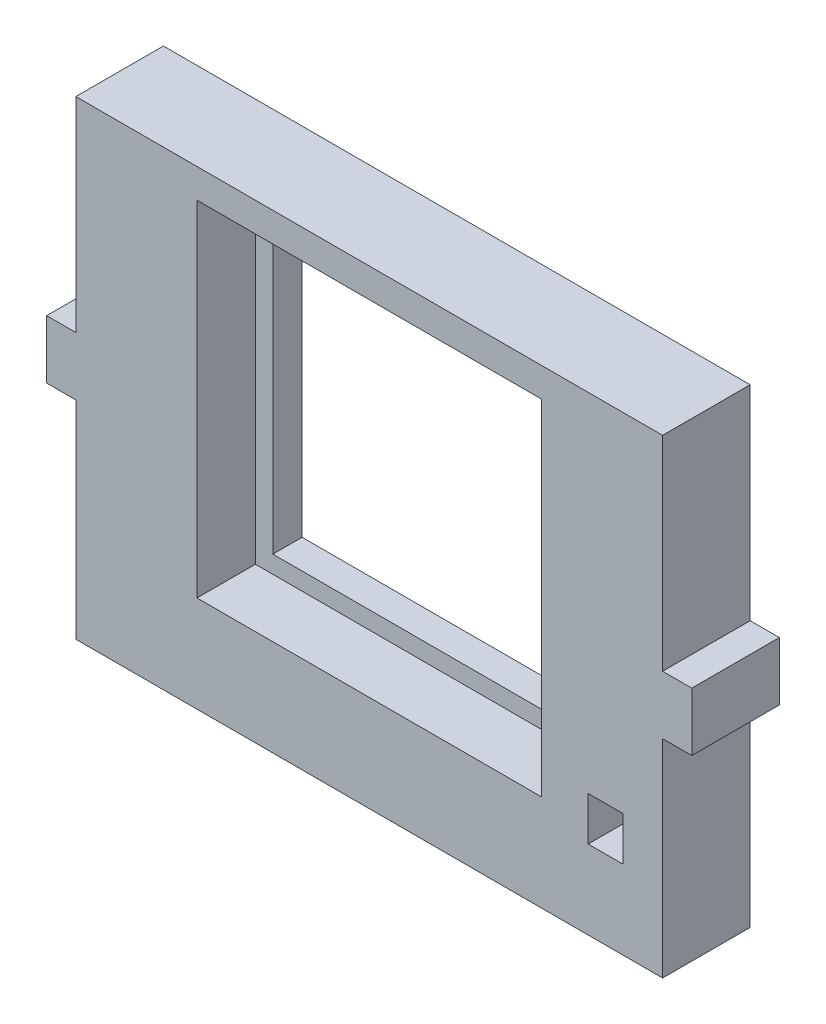
ISO-10303-21;
HEADER;
FILE_DESCRIPTION(('STEP AP214'),'2;1');
FILE_NAME('part.step','',(''),(''),'','','');
FILE_SCHEMA(('AUTOMOTIVE_DESIGN { 1 0 10303 214 1 1 1 1 }'));
ENDSEC;
DATA;
#1=APPLICATION_CONTEXT('core data for automotive mechanical design processes');
#2=APPLICATION_PROTOCOL_DEFINITION('international standard','automotive_design',2000,#1);
#3=PRODUCT_CONTEXT('',#1,'mechanical');
#4=PRODUCT('Part','Part','',(#3));
#5=PRODUCT_RELATED_PRODUCT_CATEGORY('part','',(#4));
#6=PRODUCT_DEFINITION_FORMATION('','',#4);
#7=PRODUCT_DEFINITION_CONTEXT('part definition',#1,'design');
#8=PRODUCT_DEFINITION('design','',#6,#7);
#9=PRODUCT_DEFINITION_SHAPE('','',#8);
#10=(LENGTH_UNIT() NAMED_UNIT(*) SI_UNIT(.MILLI.,.METRE.));
#11=(NAMED_UNIT(*) PLANE_ANGLE_UNIT() SI_UNIT($,.RADIAN.));
#12=(NAMED_UNIT(*) SI_UNIT($,.STERADIAN.) SOLID_ANGLE_UNIT());
#13=UNCERTAINTY_MEASURE_WITH_UNIT(LENGTH_MEASURE(1.E-05),#10,'distance_accuracy_value','');
#14=(GEOMETRIC_REPRESENTATION_CONTEXT(3) GLOBAL_UNCERTAINTY_ASSIGNED_CONTEXT((#13)) GLOBAL_UNIT_ASSIGNED_CONTEXT((#10,
#11,#12)) REPRESENTATION_CONTEXT('',''));
#15=CARTESIAN_POINT('',(0.,0.,0.));
#16=DIRECTION('',(0.,0.,1.));
#17=DIRECTION('',(1.,0.,0.));
#18=AXIS2_PLACEMENT_3D('',#15,#16,#17);
#19=CARTESIAN_POINT('',(0.,26.946,15.));
#20=DIRECTION('',(0.,1.,0.));
#21=DIRECTION('',(-1.,0.,0.));
#22=AXIS2_PLACEMENT_3D('',#19,#20,#21);
#23=PLANE('',#22);
#24=DIRECTION('',(1.,0.,0.));
#25=VECTOR('',#24,1.);
#26=CARTESIAN_POINT('',(0.,26.946,5.));
#27=LINE('',#26,#25);
#28=CARTESIAN_POINT('',(-36.0555367727771,26.946,5.));
#29=VERTEX_POINT('',#28);
#30=CARTESIAN_POINT('',(16.9444632272229,26.946,5.));
#31=VERTEX_POINT('',#30);
#32=EDGE_CURVE('E257',#29,#31,#27,.T.);
#33=ORIENTED_EDGE('',*,*,#32,.F.);
#34=DIRECTION('',(0.,0.,-1.));
#35=VECTOR('',#34,1.);
#36=CARTESIAN_POINT('',(-36.0555367727771,26.946,15.));
#37=LINE('',#36,#35);
#38=CARTESIAN_POINT('',(-36.0555367727771,26.946,0.));
#39=VERTEX_POINT('',#38);
#40=EDGE_CURVE('E387',#29,#39,#37,.T.);
#41=ORIENTED_EDGE('',*,*,#40,.T.);
#42=DIRECTION('',(1.,0.,0.));
#43=VECTOR('',#42,1.);
#44=CARTESIAN_POINT('',(0.,26.946,0.));
#45=LINE('',#44,#43);
#46=CARTESIAN_POINT('',(16.9444632272229,26.946,0.));
#47=VERTEX_POINT('',#46);
#48=EDGE_CURVE('E372',#39,#47,#45,.T.);
#49=ORIENTED_EDGE('',*,*,#48,.T.);
#50=DIRECTION('',(0.,0.,-1.));
#51=VECTOR('',#50,1.);
#52=CARTESIAN_POINT('',(16.9444632272229,26.946,15.));
#53=LINE('',#52,#51);
#54=EDGE_CURVE('E50',#31,#47,#53,.T.);
#55=ORIENTED_EDGE('',*,*,#54,.F.);
#56=EDGE_LOOP('',(#33,#41,#49,#55));
#57=FACE_BOUND('',#56,.T.);
#58=ADVANCED_FACE('F41',(#57),#23,.F.);
#59=CARTESIAN_POINT('',(16.9444632272229,0.,15.));
#60=DIRECTION('',(1.,0.,0.));
#61=DIRECTION('',(0.,1.,0.));
#62=AXIS2_PLACEMENT_3D('',#59,#60,#61);
#63=PLANE('',#62);
#64=DIRECTION('',(0.,-1.,0.));
#65=VECTOR('',#64,1.);
#66=CARTESIAN_POINT('',(16.9444632272229,0.,5.));
#67=LINE('',#66,#65);
#68=CARTESIAN_POINT('',(16.9444632272229,-26.054,5.));
#69=VERTEX_POINT('',#68);
#70=EDGE_CURVE('E254',#31,#69,#67,.T.);
#71=ORIENTED_EDGE('',*,*,#70,.F.);
#72=ORIENTED_EDGE('',*,*,#54,.T.);
#73=DIRECTION('',(0.,-1.,0.));
#74=VECTOR('',#73,1.);
#75=CARTESIAN_POINT('',(16.9444632272229,0.,0.));
#76=LINE('',#75,#74);
#77=CARTESIAN_POINT('',(16.9444632272229,-26.054,0.));
#78=VERTEX_POINT('',#77);
#79=EDGE_CURVE('E376',#47,#78,#76,.T.);
#80=ORIENTED_EDGE('',*,*,#79,.T.);
#81=DIRECTION('',(0.,0.,-1.));
#82=VECTOR('',#81,1.);
#83=CARTESIAN_POINT('',(16.9444632272229,-26.054,15.));
#84=LINE('',#83,#82);
#85=EDGE_CURVE('E394',#69,#78,#84,.T.);
#86=ORIENTED_EDGE('',*,*,#85,.F.);
#87=EDGE_LOOP('',(#71,#72,#80,#86));
#88=FACE_BOUND('',#87,.T.);
#89=ADVANCED_FACE('F519',(#88),#63,.F.);
#90=CARTESIAN_POINT('',(0.,-26.054,15.));
#91=DIRECTION('',(0.,1.,0.));
#92=DIRECTION('',(0.,0.,1.));
#93=AXIS2_PLACEMENT_3D('',#90,#91,#92);
#94=PLANE('',#93);
#95=DIRECTION('',(0.,0.,-1.));
#96=VECTOR('',#95,1.);
#97=CARTESIAN_POINT('',(-36.0555367727771,-26.054,15.));
#98=LINE('',#97,#96);
#99=CARTESIAN_POINT('',(-36.0555367727771,-26.054,5.));
#100=VERTEX_POINT('',#99);
#101=CARTESIAN_POINT('',(-36.0555367727771,-26.054,0.));
#102=VERTEX_POINT('',#101);
#103=EDGE_CURVE('E390',#100,#102,#98,.T.);
#104=ORIENTED_EDGE('',*,*,#103,.F.);
#105=DIRECTION('',(1.,0.,0.));
#106=VECTOR('',#105,1.);
#107=CARTESIAN_POINT('',(0.,-26.054,5.));
#108=LINE('',#107,#106);
#109=EDGE_CURVE('E57',#100,#69,#108,.T.);
#110=ORIENTED_EDGE('',*,*,#109,.T.);
#111=ORIENTED_EDGE('',*,*,#85,.T.);
#112=DIRECTION('',(1.,0.,0.));
#113=VECTOR('',#112,1.);
#114=CARTESIAN_POINT('',(0.,-26.054,0.));
#115=LINE('',#114,#113);
#116=EDGE_CURVE('E380',#102,#78,#115,.T.);
#117=ORIENTED_EDGE('',*,*,#116,.F.);
#118=EDGE_LOOP('',(#104,#110,#111,#117));
#119=FACE_BOUND('',#118,.T.);
#120=ADVANCED_FACE('F525',(#119),#94,.T.);
#121=CARTESIAN_POINT('',(-36.0555367727771,0.,15.));
#122=DIRECTION('',(1.,0.,0.));
#123=DIRECTION('',(0.,0.,-1.));
#124=AXIS2_PLACEMENT_3D('',#121,#122,#123);
#125=PLANE('',#124);
#126=ORIENTED_EDGE('',*,*,#40,.F.);
#127=DIRECTION('',(0.,-1.,0.));
#128=VECTOR('',#127,1.);
#129=CARTESIAN_POINT('',(-36.0555367727771,0.,5.));
#130=LINE('',#129,#128);
#131=EDGE_CURVE('E11',#29,#100,#130,.T.);
#132=ORIENTED_EDGE('',*,*,#131,.T.);
#133=ORIENTED_EDGE('',*,*,#103,.T.);
#134=DIRECTION('',(0.,-1.,0.));
#135=VECTOR('',#134,1.);
#136=CARTESIAN_POINT('',(-36.0555367727771,0.,0.));
#137=LINE('',#136,#135);
#138=EDGE_CURVE('E266',#39,#102,#137,.T.);
#139=ORIENTED_EDGE('',*,*,#138,.F.);
#140=EDGE_LOOP('',(#126,#132,#133,#139));
#141=FACE_BOUND('',#140,.T.);
#142=ADVANCED_FACE('F544',(#141),#125,.T.);
#143=CARTESIAN_POINT('',(33.9444632272229,0.,15.));
#144=DIRECTION('',(-1.,0.,0.));
#145=DIRECTION('',(0.,0.,1.));
#146=AXIS2_PLACEMENT_3D('',#143,#144,#145);
#147=PLANE('',#146);
#148=DIRECTION('',(0.,1.,0.));
#149=VECTOR('',#148,1.);
#150=CARTESIAN_POINT('',(33.9444632272229,0.,0.));
#151=LINE('',#150,#149);
#152=CARTESIAN_POINT('',(33.9444632272229,-32.054,0.));
#153=VERTEX_POINT('',#152);
#154=CARTESIAN_POINT('',(33.9444632272229,-24.554,0.));
#155=VERTEX_POINT('',#154);
#156=EDGE_CURVE('E356',#153,#155,#151,.T.);
#157=ORIENTED_EDGE('',*,*,#156,.F.);
#158=DIRECTION('',(0.,0.,-1.));
#159=VECTOR('',#158,1.);
#160=CARTESIAN_POINT('',(33.9444632272229,-32.054,15.));
#161=LINE('',#160,#159);
#162=CARTESIAN_POINT('',(33.9444632272229,-32.054,15.));
#163=VERTEX_POINT('',#162);
#164=EDGE_CURVE('E391',#163,#153,#161,.T.);
#165=ORIENTED_EDGE('',*,*,#164,.F.);
#166=DIRECTION('',(0.,1.,0.));
#167=VECTOR('',#166,1.);
#168=CARTESIAN_POINT('',(33.9444632272229,0.,15.));
#169=LINE('',#168,#167);
#170=CARTESIAN_POINT('',(33.9444632272229,-24.554,15.));
#171=VERTEX_POINT('',#170);
#172=EDGE_CURVE('E300',#163,#171,#169,.T.);
#173=ORIENTED_EDGE('',*,*,#172,.T.);
#174=DIRECTION('',(0.,0.,-1.));
#175=VECTOR('',#174,1.);
#176=CARTESIAN_POINT('',(33.9444632272229,-24.554,15.));
#177=LINE('',#176,#175);
#178=EDGE_CURVE('E399',#171,#155,#177,.T.);
#179=ORIENTED_EDGE('',*,*,#178,.T.);
#180=EDGE_LOOP('',(#157,#165,#173,#179));
#181=FACE_BOUND('',#180,.T.);
#182=ADVANCED_FACE('F541',(#181),#147,.T.);
#183=CARTESIAN_POINT('',(0.,-32.054,15.));
#184=DIRECTION('',(0.,1.,0.));
#185=DIRECTION('',(0.,0.,1.));
#186=AXIS2_PLACEMENT_3D('',#183,#184,#185);
#187=PLANE('',#186);
#188=DIRECTION('',(1.,0.,0.));
#189=VECTOR('',#188,1.);
#190=CARTESIAN_POINT('',(0.,-32.054,0.));
#191=LINE('',#190,#189);
#192=CARTESIAN_POINT('',(27.9444632272229,-32.054,0.));
#193=VERTEX_POINT('',#192);
#194=EDGE_CURVE('E360',#193,#153,#191,.T.);
#195=ORIENTED_EDGE('',*,*,#194,.F.);
#196=DIRECTION('',(0.,0.,-1.));
#197=VECTOR('',#196,1.);
#198=CARTESIAN_POINT('',(27.9444632272229,-32.054,15.));
#199=LINE('',#198,#197);
#200=CARTESIAN_POINT('',(27.9444632272229,-32.054,15.));
#201=VERTEX_POINT('',#200);
#202=EDGE_CURVE('E407',#201,#193,#199,.T.);
#203=ORIENTED_EDGE('',*,*,#202,.F.);
#204=DIRECTION('',(1.,0.,0.));
#205=VECTOR('',#204,1.);
#206=CARTESIAN_POINT('',(0.,-32.054,15.));
#207=LINE('',#206,#205);
#208=EDGE_CURVE('E304',#201,#163,#207,.T.);
#209=ORIENTED_EDGE('',*,*,#208,.T.);
#210=ORIENTED_EDGE('',*,*,#164,.T.);
#211=EDGE_LOOP('',(#195,#203,#209,#210));
#212=FACE_BOUND('',#211,.T.);
#213=ADVANCED_FACE('F538',(#212),#187,.T.);
#214=CARTESIAN_POINT('',(27.9444632272229,0.,15.));
#215=DIRECTION('',(-1.,0.,0.));
#216=DIRECTION('',(0.,0.,1.));
#217=AXIS2_PLACEMENT_3D('',#214,#215,#216);
#218=PLANE('',#217);
#219=DIRECTION('',(0.,1.,0.));
#220=VECTOR('',#219,1.);
#221=CARTESIAN_POINT('',(27.9444632272229,0.,0.));
#222=LINE('',#221,#220);
#223=CARTESIAN_POINT('',(27.9444632272229,-24.554,0.));
#224=VERTEX_POINT('',#223);
#225=EDGE_CURVE('E364',#193,#224,#222,.T.);
#226=ORIENTED_EDGE('',*,*,#225,.T.);
#227=DIRECTION('',(0.,0.,-1.));
#228=VECTOR('',#227,1.);
#229=CARTESIAN_POINT('',(27.9444632272229,-24.554,15.));
#230=LINE('',#229,#228);
#231=CARTESIAN_POINT('',(27.9444632272229,-24.554,15.));
#232=VERTEX_POINT('',#231);
#233=EDGE_CURVE('E402',#232,#224,#230,.T.);
#234=ORIENTED_EDGE('',*,*,#233,.F.);
#235=DIRECTION('',(0.,1.,0.));
#236=VECTOR('',#235,1.);
#237=CARTESIAN_POINT('',(27.9444632272229,0.,15.));
#238=LINE('',#237,#236);
#239=EDGE_CURVE('E308',#201,#232,#238,.T.);
#240=ORIENTED_EDGE('',*,*,#239,.F.);
#241=ORIENTED_EDGE('',*,*,#202,.T.);
#242=EDGE_LOOP('',(#226,#234,#240,#241));
#243=FACE_BOUND('',#242,.T.);
#244=ADVANCED_FACE('F535',(#243),#218,.F.);
#245=CARTESIAN_POINT('',(0.,-0.0539999999999552,15.));
#246=DIRECTION('',(0.,-1.,0.));
#247=DIRECTION('',(1.,0.,0.));
#248=AXIS2_PLACEMENT_3D('',#245,#246,#247);
#249=PLANE('',#248);
#250=DIRECTION('',(-1.,0.,0.));
#251=VECTOR('',#250,1.);
#252=CARTESIAN_POINT('',(0.,-0.0539999999999552,0.));
#253=LINE('',#252,#251);
#254=CARTESIAN_POINT('',(-59.8055367727771,-0.0539999999999768,0.));
#255=VERTEX_POINT('',#254);
#256=CARTESIAN_POINT('',(-64.8055367727771,-0.0539999999999777,0.));
#257=VERTEX_POINT('',#256);
#258=EDGE_CURVE('E260',#255,#257,#253,.T.);
#259=ORIENTED_EDGE('',*,*,#258,.T.);
#260=DIRECTION('',(0.,0.,-1.));
#261=VECTOR('',#260,1.);
#262=CARTESIAN_POINT('',(-64.8055367727771,-0.0539999999999777,15.));
#263=LINE('',#262,#261);
#264=CARTESIAN_POINT('',(-64.8055367727771,-0.0539999999999777,15.));
#265=VERTEX_POINT('',#264);
#266=EDGE_CURVE('E403',#265,#257,#263,.T.);
#267=ORIENTED_EDGE('',*,*,#266,.F.);
#268=DIRECTION('',(-1.,0.,0.));
#269=VECTOR('',#268,1.);
#270=CARTESIAN_POINT('',(0.,-0.0539999999999552,15.));
#271=LINE('',#270,#269);
#272=CARTESIAN_POINT('',(-59.8055367727771,-0.0539999999999768,15.));
#273=VERTEX_POINT('',#272);
#274=EDGE_CURVE('E261',#273,#265,#271,.T.);
#275=ORIENTED_EDGE('',*,*,#274,.F.);
#276=DIRECTION('',(0.,0.,-1.));
#277=VECTOR('',#276,1.);
#278=CARTESIAN_POINT('',(-59.8055367727771,-0.0539999999999768,15.));
#279=LINE('',#278,#277);
#280=EDGE_CURVE('E315',#273,#255,#279,.T.);
#281=ORIENTED_EDGE('',*,*,#280,.T.);
#282=EDGE_LOOP('',(#259,#267,#275,#281));
#283=FACE_BOUND('',#282,.T.);
#284=ADVANCED_FACE('F43',(#283),#249,.F.);
#285=CARTESIAN_POINT('',(-64.8055367727771,0.,15.));
#286=DIRECTION('',(1.,0.,0.));
#287=DIRECTION('',(0.,0.,-1.));
#288=AXIS2_PLACEMENT_3D('',#285,#286,#287);
#289=PLANE('',#288);
#290=DIRECTION('',(0.,-1.,0.));
#291=VECTOR('',#290,1.);
#292=CARTESIAN_POINT('',(-64.8055367727771,0.,0.));
#293=LINE('',#292,#291);
#294=CARTESIAN_POINT('',(-64.8055367727771,-10.054,0.));
#295=VERTEX_POINT('',#294);
#296=EDGE_CURVE('E319',#257,#295,#293,.T.);
#297=ORIENTED_EDGE('',*,*,#296,.T.);
#298=DIRECTION('',(0.,0.,-1.));
#299=VECTOR('',#298,1.);
#300=CARTESIAN_POINT('',(-64.8055367727771,-10.054,15.));
#301=LINE('',#300,#299);
#302=CARTESIAN_POINT('',(-64.8055367727771,-10.054,15.));
#303=VERTEX_POINT('',#302);
#304=EDGE_CURVE('E443',#303,#295,#301,.T.);
#305=ORIENTED_EDGE('',*,*,#304,.F.);
#306=DIRECTION('',(0.,-1.,0.));
#307=VECTOR('',#306,1.);
#308=CARTESIAN_POINT('',(-64.8055367727771,0.,15.));
#309=LINE('',#308,#307);
#310=EDGE_CURVE('E265',#265,#303,#309,.T.);
#311=ORIENTED_EDGE('',*,*,#310,.F.);
#312=ORIENTED_EDGE('',*,*,#266,.T.);
#313=EDGE_LOOP('',(#297,#305,#311,#312));
#314=FACE_BOUND('',#313,.T.);
#315=ADVANCED_FACE('F449',(#314),#289,.F.);
#316=CARTESIAN_POINT('',(0.,-10.054,15.));
#317=DIRECTION('',(0.,-1.,0.));
#318=DIRECTION('',(0.,0.,-1.));
#319=AXIS2_PLACEMENT_3D('',#316,#317,#318);
#320=PLANE('',#319);
#321=DIRECTION('',(-1.,0.,0.));
#322=VECTOR('',#321,1.);
#323=CARTESIAN_POINT('',(0.,-10.054,0.));
#324=LINE('',#323,#322);
#325=CARTESIAN_POINT('',(-59.8055367727771,-10.054,0.));
#326=VERTEX_POINT('',#325);
#327=EDGE_CURVE('E323',#326,#295,#324,.T.);
#328=ORIENTED_EDGE('',*,*,#327,.F.);
#329=DIRECTION('',(0.,0.,-1.));
#330=VECTOR('',#329,1.);
#331=CARTESIAN_POINT('',(-59.8055367727771,-10.054,15.));
#332=LINE('',#331,#330);
#333=CARTESIAN_POINT('',(-59.8055367727771,-10.054,15.));
#334=VERTEX_POINT('',#333);
#335=EDGE_CURVE('E440',#334,#326,#332,.T.);
#336=ORIENTED_EDGE('',*,*,#335,.F.);
#337=DIRECTION('',(-1.,0.,0.));
#338=VECTOR('',#337,1.);
#339=CARTESIAN_POINT('',(0.,-10.054,15.));
#340=LINE('',#339,#338);
#341=EDGE_CURVE('E269',#334,#303,#340,.T.);
#342=ORIENTED_EDGE('',*,*,#341,.T.);
#343=ORIENTED_EDGE('',*,*,#304,.T.);
#344=EDGE_LOOP('',(#328,#336,#342,#343));
#345=FACE_BOUND('',#344,.T.);
#346=ADVANCED_FACE('F464',(#345),#320,.T.);
#347=CARTESIAN_POINT('',(-59.8055367727771,0.,15.));
#348=DIRECTION('',(1.,0.,0.));
#349=DIRECTION('',(0.,1.,0.));
#350=AXIS2_PLACEMENT_3D('',#347,#348,#349);
#351=PLANE('',#350);
#352=DIRECTION('',(0.,-1.,0.));
#353=VECTOR('',#352,1.);
#354=CARTESIAN_POINT('',(-59.8055367727771,0.,0.));
#355=LINE('',#354,#353);
#356=CARTESIAN_POINT('',(-59.8055367727771,-45.554,0.));
#357=VERTEX_POINT('',#356);
#358=EDGE_CURVE('E327',#326,#357,#355,.T.);
#359=ORIENTED_EDGE('',*,*,#358,.T.);
#360=DIRECTION('',(0.,0.,-1.));
#361=VECTOR('',#360,1.);
#362=CARTESIAN_POINT('',(-59.8055367727771,-45.554,15.));
#363=LINE('',#362,#361);
#364=CARTESIAN_POINT('',(-59.8055367727771,-45.554,15.));
#365=VERTEX_POINT('',#364);
#366=EDGE_CURVE('E436',#365,#357,#363,.T.);
#367=ORIENTED_EDGE('',*,*,#366,.F.);
#368=DIRECTION('',(0.,-1.,0.));
#369=VECTOR('',#368,1.);
#370=CARTESIAN_POINT('',(-59.8055367727771,0.,15.));
#371=LINE('',#370,#369);
#372=EDGE_CURVE('E273',#334,#365,#371,.T.);
#373=ORIENTED_EDGE('',*,*,#372,.F.);
#374=ORIENTED_EDGE('',*,*,#335,.T.);
#375=EDGE_LOOP('',(#359,#367,#373,#374));
#376=FACE_BOUND('',#375,.T.);
#377=ADVANCED_FACE('F505',(#376),#351,.F.);
#378=CARTESIAN_POINT('',(0.,-45.554,15.));
#379=DIRECTION('',(0.,1.,0.));
#380=DIRECTION('',(0.,0.,1.));
#381=AXIS2_PLACEMENT_3D('',#378,#379,#380);
#382=PLANE('',#381);
#383=DIRECTION('',(1.,0.,0.));
#384=VECTOR('',#383,1.);
#385=CARTESIAN_POINT('',(0.,-45.554,0.));
#386=LINE('',#385,#384);
#387=CARTESIAN_POINT('',(40.6944632272229,-45.554,0.));
#388=VERTEX_POINT('',#387);
#389=EDGE_CURVE('E330',#357,#388,#386,.T.);
#390=ORIENTED_EDGE('',*,*,#389,.T.);
#391=DIRECTION('',(0.,0.,-1.));
#392=VECTOR('',#391,1.);
#393=CARTESIAN_POINT('',(40.6944632272229,-45.554,15.));
#394=LINE('',#393,#392);
#395=CARTESIAN_POINT('',(40.6944632272229,-45.554,15.));
#396=VERTEX_POINT('',#395);
#397=EDGE_CURVE('E433',#396,#388,#394,.T.);
#398=ORIENTED_EDGE('',*,*,#397,.F.);
#399=DIRECTION('',(1.,0.,0.));
#400=VECTOR('',#399,1.);
#401=CARTESIAN_POINT('',(0.,-45.554,15.));
#402=LINE('',#401,#400);
#403=EDGE_CURVE('E276',#365,#396,#402,.T.);
#404=ORIENTED_EDGE('',*,*,#403,.F.);
#405=ORIENTED_EDGE('',*,*,#366,.T.);
#406=EDGE_LOOP('',(#390,#398,#404,#405));
#407=FACE_BOUND('',#406,.T.);
#408=ADVANCED_FACE('F503',(#407),#382,.F.);
#409=CARTESIAN_POINT('',(40.6944632272229,0.,15.));
#410=DIRECTION('',(1.,0.,0.));
#411=DIRECTION('',(0.,0.,-1.));
#412=AXIS2_PLACEMENT_3D('',#409,#410,#411);
#413=PLANE('',#412);
#414=DIRECTION('',(0.,-1.,0.));
#415=VECTOR('',#414,1.);
#416=CARTESIAN_POINT('',(40.6944632272229,0.,0.));
#417=LINE('',#416,#415);
#418=CARTESIAN_POINT('',(40.6944632272229,-10.054,0.));
#419=VERTEX_POINT('',#418);
#420=EDGE_CURVE('E335',#419,#388,#417,.T.);
#421=ORIENTED_EDGE('',*,*,#420,.F.);
#422=DIRECTION('',(0.,0.,-1.));
#423=VECTOR('',#422,1.);
#424=CARTESIAN_POINT('',(40.6944632272229,-10.054,15.));
#425=LINE('',#424,#423);
#426=CARTESIAN_POINT('',(40.6944632272229,-10.054,15.));
#427=VERTEX_POINT('',#426);
#428=EDGE_CURVE('E430',#427,#419,#425,.T.);
#429=ORIENTED_EDGE('',*,*,#428,.F.);
#430=DIRECTION('',(0.,-1.,0.));
#431=VECTOR('',#430,1.);
#432=CARTESIAN_POINT('',(40.6944632272229,0.,15.));
#433=LINE('',#432,#431);
#434=EDGE_CURVE('E280',#427,#396,#433,.T.);
#435=ORIENTED_EDGE('',*,*,#434,.T.);
#436=ORIENTED_EDGE('',*,*,#397,.T.);
#437=EDGE_LOOP('',(#421,#429,#435,#436));
#438=FACE_BOUND('',#437,.T.);
#439=ADVANCED_FACE('F497',(#438),#413,.T.);
#440=CARTESIAN_POINT('',(0.,-10.054,15.));
#441=DIRECTION('',(0.,1.,0.));
#442=DIRECTION('',(-1.,0.,0.));
#443=AXIS2_PLACEMENT_3D('',#440,#441,#442);
#444=PLANE('',#443);
#445=DIRECTION('',(1.,0.,0.));
#446=VECTOR('',#445,1.);
#447=CARTESIAN_POINT('',(0.,-10.054,0.));
#448=LINE('',#447,#446);
#449=CARTESIAN_POINT('',(45.6944632272229,-10.054,0.));
#450=VERTEX_POINT('',#449);
#451=EDGE_CURVE('E339',#419,#450,#448,.T.);
#452=ORIENTED_EDGE('',*,*,#451,.T.);
#453=DIRECTION('',(0.,0.,-1.));
#454=VECTOR('',#453,1.);
#455=CARTESIAN_POINT('',(45.6944632272229,-10.054,15.));
#456=LINE('',#455,#454);
#457=CARTESIAN_POINT('',(45.6944632272229,-10.054,15.));
#458=VERTEX_POINT('',#457);
#459=EDGE_CURVE('E427',#458,#450,#456,.T.);
#460=ORIENTED_EDGE('',*,*,#459,.F.);
#461=DIRECTION('',(1.,0.,0.));
#462=VECTOR('',#461,1.);
#463=CARTESIAN_POINT('',(0.,-10.054,15.));
#464=LINE('',#463,#462);
#465=EDGE_CURVE('E284',#427,#458,#464,.T.);
#466=ORIENTED_EDGE('',*,*,#465,.F.);
#467=ORIENTED_EDGE('',*,*,#428,.T.);
#468=EDGE_LOOP('',(#452,#460,#466,#467));
#469=FACE_BOUND('',#468,.T.);
#470=ADVANCED_FACE('F695',(#469),#444,.F.);
#471=CARTESIAN_POINT('',(45.6944632272229,0.,15.));
#472=DIRECTION('',(1.,0.,0.));
#473=DIRECTION('',(0.,1.,0.));
#474=AXIS2_PLACEMENT_3D('',#471,#472,#473);
#475=PLANE('',#474);
#476=DIRECTION('',(0.,-1.,0.));
#477=VECTOR('',#476,1.);
#478=CARTESIAN_POINT('',(45.6944632272229,0.,0.));
#479=LINE('',#478,#477);
#480=CARTESIAN_POINT('',(45.6944632272229,-0.0539999999999777,0.));
#481=VERTEX_POINT('',#480);
#482=EDGE_CURVE('E344',#481,#450,#479,.T.);
#483=ORIENTED_EDGE('',*,*,#482,.F.);
#484=DIRECTION('',(0.,0.,-1.));
#485=VECTOR('',#484,1.);
#486=CARTESIAN_POINT('',(45.6944632272229,-0.0539999999999777,15.));
#487=LINE('',#486,#485);
#488=CARTESIAN_POINT('',(45.6944632272229,-0.0539999999999777,15.));
#489=VERTEX_POINT('',#488);
#490=EDGE_CURVE('E424',#489,#481,#487,.T.);
#491=ORIENTED_EDGE('',*,*,#490,.F.);
#492=DIRECTION('',(0.,-1.,0.));
#493=VECTOR('',#492,1.);
#494=CARTESIAN_POINT('',(45.6944632272229,0.,15.));
#495=LINE('',#494,#493);
#496=EDGE_CURVE('E288',#489,#458,#495,.T.);
#497=ORIENTED_EDGE('',*,*,#496,.T.);
#498=ORIENTED_EDGE('',*,*,#459,.T.);
#499=EDGE_LOOP('',(#483,#491,#497,#498));
#500=FACE_BOUND('',#499,.T.);
#501=ADVANCED_FACE('F491',(#500),#475,.T.);
#502=CARTESIAN_POINT('',(0.,-0.0539999999999777,15.));
#503=DIRECTION('',(0.,1.,0.));
#504=DIRECTION('',(0.,0.,1.));
#505=AXIS2_PLACEMENT_3D('',#502,#503,#504);
#506=PLANE('',#505);
#507=DIRECTION('',(1.,0.,0.));
#508=VECTOR('',#507,1.);
#509=CARTESIAN_POINT('',(0.,-0.0539999999999777,0.));
#510=LINE('',#509,#508);
#511=CARTESIAN_POINT('',(40.6944632272229,-0.0539999999999777,0.));
#512=VERTEX_POINT('',#511);
#513=EDGE_CURVE('E348',#512,#481,#510,.T.);
#514=ORIENTED_EDGE('',*,*,#513,.F.);
#515=DIRECTION('',(0.,0.,-1.));
#516=VECTOR('',#515,1.);
#517=CARTESIAN_POINT('',(40.6944632272229,-0.0539999999999777,15.));
#518=LINE('',#517,#516);
#519=CARTESIAN_POINT('',(40.6944632272229,-0.0539999999999777,15.));
#520=VERTEX_POINT('',#519);
#521=EDGE_CURVE('E421',#520,#512,#518,.T.);
#522=ORIENTED_EDGE('',*,*,#521,.F.);
#523=DIRECTION('',(1.,0.,0.));
#524=VECTOR('',#523,1.);
#525=CARTESIAN_POINT('',(0.,-0.0539999999999777,15.));
#526=LINE('',#525,#524);
#527=EDGE_CURVE('E292',#520,#489,#526,.T.);
#528=ORIENTED_EDGE('',*,*,#527,.T.);
#529=ORIENTED_EDGE('',*,*,#490,.T.);
#530=EDGE_LOOP('',(#514,#522,#528,#529));
#531=FACE_BOUND('',#530,.T.);
#532=ADVANCED_FACE('F487',(#531),#506,.T.);
#533=CARTESIAN_POINT('',(40.6944632272229,34.946,0.));
#534=VERTEX_POINT('',#533);
#535=EDGE_CURVE('E340',#534,#512,#417,.T.);
#536=ORIENTED_EDGE('',*,*,#535,.F.);
#537=DIRECTION('',(0.,0.,-1.));
#538=VECTOR('',#537,1.);
#539=CARTESIAN_POINT('',(40.6944632272229,34.946,15.));
#540=LINE('',#539,#538);
#541=CARTESIAN_POINT('',(40.6944632272229,34.946,15.));
#542=VERTEX_POINT('',#541);
#543=EDGE_CURVE('E418',#542,#534,#540,.T.);
#544=ORIENTED_EDGE('',*,*,#543,.F.);
#545=EDGE_CURVE('E285',#542,#520,#433,.T.);
#546=ORIENTED_EDGE('',*,*,#545,.T.);
#547=ORIENTED_EDGE('',*,*,#521,.T.);
#548=EDGE_LOOP('',(#536,#544,#546,#547));
#549=FACE_BOUND('',#548,.T.);
#550=ADVANCED_FACE('F483',(#549),#413,.T.);
#551=CARTESIAN_POINT('',(0.,34.946,15.));
#552=DIRECTION('',(0.,1.,0.));
#553=DIRECTION('',(0.,0.,1.));
#554=AXIS2_PLACEMENT_3D('',#551,#552,#553);
#555=PLANE('',#554);
#556=DIRECTION('',(1.,0.,0.));
#557=VECTOR('',#556,1.);
#558=CARTESIAN_POINT('',(0.,34.946,0.));
#559=LINE('',#558,#557);
#560=CARTESIAN_POINT('',(-59.8055367727771,34.946,0.));
#561=VERTEX_POINT('',#560);
#562=EDGE_CURVE('E352',#561,#534,#559,.T.);
#563=ORIENTED_EDGE('',*,*,#562,.F.);
#564=DIRECTION('',(0.,0.,-1.));
#565=VECTOR('',#564,1.);
#566=CARTESIAN_POINT('',(-59.8055367727771,34.946,15.));
#567=LINE('',#566,#565);
#568=CARTESIAN_POINT('',(-59.8055367727771,34.946,15.));
#569=VERTEX_POINT('',#568);
#570=EDGE_CURVE('E415',#569,#561,#567,.T.);
#571=ORIENTED_EDGE('',*,*,#570,.F.);
#572=DIRECTION('',(1.,0.,0.));
#573=VECTOR('',#572,1.);
#574=CARTESIAN_POINT('',(0.,34.946,15.));
#575=LINE('',#574,#573);
#576=EDGE_CURVE('E296',#569,#542,#575,.T.);
#577=ORIENTED_EDGE('',*,*,#576,.T.);
#578=ORIENTED_EDGE('',*,*,#543,.T.);
#579=EDGE_LOOP('',(#563,#571,#577,#578));
#580=FACE_BOUND('',#579,.T.);
#581=ADVANCED_FACE('F533',(#580),#555,.T.);
#582=CARTESIAN_POINT('',(0.,-24.554,15.));
#583=DIRECTION('',(0.,1.,0.));
#584=DIRECTION('',(0.,0.,1.));
#585=AXIS2_PLACEMENT_3D('',#582,#583,#584);
#586=PLANE('',#585);
#587=DIRECTION('',(1.,0.,0.));
#588=VECTOR('',#587,1.);
#589=CARTESIAN_POINT('',(0.,-24.554,0.));
#590=LINE('',#589,#588);
#591=EDGE_CURVE('E368',#224,#155,#590,.T.);
#592=ORIENTED_EDGE('',*,*,#591,.T.);
#593=ORIENTED_EDGE('',*,*,#178,.F.);
#594=DIRECTION('',(1.,0.,0.));
#595=VECTOR('',#594,1.);
#596=CARTESIAN_POINT('',(0.,-24.554,15.));
#597=LINE('',#596,#595);
#598=EDGE_CURVE('E312',#232,#171,#597,.T.);
#599=ORIENTED_EDGE('',*,*,#598,.F.);
#600=ORIENTED_EDGE('',*,*,#233,.T.);
#601=EDGE_LOOP('',(#592,#593,#599,#600));
#602=FACE_BOUND('',#601,.T.);
#603=ADVANCED_FACE('F517',(#602),#586,.F.);
#604=EDGE_CURVE('E331',#561,#255,#355,.T.);
#605=ORIENTED_EDGE('',*,*,#604,.T.);
#606=ORIENTED_EDGE('',*,*,#280,.F.);
#607=EDGE_CURVE('E277',#569,#273,#371,.T.);
#608=ORIENTED_EDGE('',*,*,#607,.F.);
#609=ORIENTED_EDGE('',*,*,#570,.T.);
#610=EDGE_LOOP('',(#605,#606,#608,#609));
#611=FACE_BOUND('',#610,.T.);
#612=ADVANCED_FACE('F476',(#611),#351,.F.);
#613=CARTESIAN_POINT('',(0.,0.,15.));
#614=DIRECTION('',(0.,0.,1.));
#615=DIRECTION('',(1.,0.,0.));
#616=AXIS2_PLACEMENT_3D('',#613,#614,#615);
#617=PLANE('',#616);
#618=DIRECTION('',(0.,-1.,0.));
#619=VECTOR('',#618,1.);
#620=CARTESIAN_POINT('',(-39.0555367727772,29.946,15.));
#621=LINE('',#620,#619);
#622=CARTESIAN_POINT('',(-39.0555367727772,29.946,15.));
#623=VERTEX_POINT('',#622);
#624=CARTESIAN_POINT('',(-39.0555367727771,-29.054,15.));
#625=VERTEX_POINT('',#624);
#626=EDGE_CURVE('E64',#623,#625,#621,.T.);
#627=ORIENTED_EDGE('',*,*,#626,.F.);
#628=DIRECTION('',(-1.,0.,0.));
#629=VECTOR('',#628,1.);
#630=CARTESIAN_POINT('',(-39.0555367727772,29.946,15.));
#631=LINE('',#630,#629);
#632=CARTESIAN_POINT('',(19.9444632272228,29.946,15.));
#633=VERTEX_POINT('',#632);
#634=EDGE_CURVE('E225',#633,#623,#631,.T.);
#635=ORIENTED_EDGE('',*,*,#634,.F.);
#636=DIRECTION('',(0.,1.,0.));
#637=VECTOR('',#636,1.);
#638=CARTESIAN_POINT('',(19.9444632272228,29.946,15.));
#639=LINE('',#638,#637);
#640=CARTESIAN_POINT('',(19.9444632272229,-29.054,15.));
#641=VERTEX_POINT('',#640);
#642=EDGE_CURVE('E229',#641,#633,#639,.T.);
#643=ORIENTED_EDGE('',*,*,#642,.F.);
#644=DIRECTION('',(1.,0.,0.));
#645=VECTOR('',#644,1.);
#646=CARTESIAN_POINT('',(-39.0555367727771,-29.054,15.));
#647=LINE('',#646,#645);
#648=EDGE_CURVE('E238',#625,#641,#647,.T.);
#649=ORIENTED_EDGE('',*,*,#648,.F.);
#650=EDGE_LOOP('',(#627,#635,#643,#649));
#651=FACE_BOUND('',#650,.T.);
#652=ORIENTED_EDGE('',*,*,#274,.T.);
#653=ORIENTED_EDGE('',*,*,#310,.T.);
#654=ORIENTED_EDGE('',*,*,#341,.F.);
#655=ORIENTED_EDGE('',*,*,#372,.T.);
#656=ORIENTED_EDGE('',*,*,#403,.T.);
#657=ORIENTED_EDGE('',*,*,#434,.F.);
#658=ORIENTED_EDGE('',*,*,#465,.T.);
#659=ORIENTED_EDGE('',*,*,#496,.F.);
#660=ORIENTED_EDGE('',*,*,#527,.F.);
#661=ORIENTED_EDGE('',*,*,#545,.F.);
#662=ORIENTED_EDGE('',*,*,#576,.F.);
#663=ORIENTED_EDGE('',*,*,#607,.T.);
#664=EDGE_LOOP('',(#652,#653,#654,#655,#656,#657,#658,#659,#660,#661,#662,#663));
#665=FACE_BOUND('',#664,.T.);
#666=ORIENTED_EDGE('',*,*,#172,.F.);
#667=ORIENTED_EDGE('',*,*,#208,.F.);
#668=ORIENTED_EDGE('',*,*,#239,.T.);
#669=ORIENTED_EDGE('',*,*,#598,.T.);
#670=EDGE_LOOP('',(#666,#667,#668,#669));
#671=FACE_BOUND('',#670,.T.);
#672=ADVANCED_FACE('F468',(#651,#665,#671),#617,.T.);
#673=CARTESIAN_POINT('',(0.,0.,0.));
#674=DIRECTION('',(0.,0.,1.));
#675=DIRECTION('',(1.,0.,0.));
#676=AXIS2_PLACEMENT_3D('',#673,#674,#675);
#677=PLANE('',#676);
#678=ORIENTED_EDGE('',*,*,#258,.F.);
#679=ORIENTED_EDGE('',*,*,#604,.F.);
#680=ORIENTED_EDGE('',*,*,#562,.T.);
#681=ORIENTED_EDGE('',*,*,#535,.T.);
#682=ORIENTED_EDGE('',*,*,#513,.T.);
#683=ORIENTED_EDGE('',*,*,#482,.T.);
#684=ORIENTED_EDGE('',*,*,#451,.F.);
#685=ORIENTED_EDGE('',*,*,#420,.T.);
#686=ORIENTED_EDGE('',*,*,#389,.F.);
#687=ORIENTED_EDGE('',*,*,#358,.F.);
#688=ORIENTED_EDGE('',*,*,#327,.T.);
#689=ORIENTED_EDGE('',*,*,#296,.F.);
#690=EDGE_LOOP('',(#678,#679,#680,#681,#682,#683,#684,#685,#686,#687,#688,#689));
#691=FACE_BOUND('',#690,.T.);
#692=ORIENTED_EDGE('',*,*,#156,.T.);
#693=ORIENTED_EDGE('',*,*,#591,.F.);
#694=ORIENTED_EDGE('',*,*,#225,.F.);
#695=ORIENTED_EDGE('',*,*,#194,.T.);
#696=EDGE_LOOP('',(#692,#693,#694,#695));
#697=FACE_BOUND('',#696,.T.);
#698=ORIENTED_EDGE('',*,*,#48,.F.);
#699=ORIENTED_EDGE('',*,*,#138,.T.);
#700=ORIENTED_EDGE('',*,*,#116,.T.);
#701=ORIENTED_EDGE('',*,*,#79,.F.);
#702=EDGE_LOOP('',(#698,#699,#700,#701));
#703=FACE_BOUND('',#702,.T.);
#704=ADVANCED_FACE('F457',(#691,#697,#703),#677,.F.);
#705=CARTESIAN_POINT('',(0.,0.,5.));
#706=DIRECTION('',(0.,0.,1.));
#707=DIRECTION('',(1.,0.,0.));
#708=AXIS2_PLACEMENT_3D('',#705,#706,#707);
#709=PLANE('',#708);
#710=DIRECTION('',(0.,-1.,0.));
#711=VECTOR('',#710,1.);
#712=CARTESIAN_POINT('',(-39.0555367727772,29.946,5.));
#713=LINE('',#712,#711);
#714=CARTESIAN_POINT('',(-39.0555367727772,29.946,5.));
#715=VERTEX_POINT('',#714);
#716=CARTESIAN_POINT('',(-39.0555367727771,-29.054,5.));
#717=VERTEX_POINT('',#716);
#718=EDGE_CURVE('E204',#715,#717,#713,.T.);
#719=ORIENTED_EDGE('',*,*,#718,.T.);
#720=DIRECTION('',(1.,0.,0.));
#721=VECTOR('',#720,1.);
#722=CARTESIAN_POINT('',(-39.0555367727771,-29.054,5.));
#723=LINE('',#722,#721);
#724=CARTESIAN_POINT('',(19.9444632272229,-29.054,5.));
#725=VERTEX_POINT('',#724);
#726=EDGE_CURVE('E214',#717,#725,#723,.T.);
#727=ORIENTED_EDGE('',*,*,#726,.T.);
#728=DIRECTION('',(0.,1.,0.));
#729=VECTOR('',#728,1.);
#730=CARTESIAN_POINT('',(19.9444632272228,29.946,5.));
#731=LINE('',#730,#729);
#732=CARTESIAN_POINT('',(19.9444632272228,29.946,5.));
#733=VERTEX_POINT('',#732);
#734=EDGE_CURVE('E220',#725,#733,#731,.T.);
#735=ORIENTED_EDGE('',*,*,#734,.T.);
#736=DIRECTION('',(-1.,0.,0.));
#737=VECTOR('',#736,1.);
#738=CARTESIAN_POINT('',(-39.0555367727772,29.946,5.));
#739=LINE('',#738,#737);
#740=EDGE_CURVE('E211',#733,#715,#739,.T.);
#741=ORIENTED_EDGE('',*,*,#740,.T.);
#742=EDGE_LOOP('',(#719,#727,#735,#741));
#743=FACE_BOUND('',#742,.T.);
#744=ORIENTED_EDGE('',*,*,#32,.T.);
#745=ORIENTED_EDGE('',*,*,#70,.T.);
#746=ORIENTED_EDGE('',*,*,#109,.F.);
#747=ORIENTED_EDGE('',*,*,#131,.F.);
#748=EDGE_LOOP('',(#744,#745,#746,#747));
#749=FACE_BOUND('',#748,.T.);
#750=ADVANCED_FACE('F222',(#743,#749),#709,.T.);
#751=CARTESIAN_POINT('',(-39.0555367727772,29.946,5.));
#752=DIRECTION('',(-1.,0.,0.));
#753=DIRECTION('',(0.,-1.,0.));
#754=AXIS2_PLACEMENT_3D('',#751,#752,#753);
#755=PLANE('',#754);
#756=ORIENTED_EDGE('',*,*,#626,.T.);
#757=DIRECTION('',(0.,0.,1.));
#758=VECTOR('',#757,1.);
#759=CARTESIAN_POINT('',(-39.0555367727771,-29.054,5.));
#760=LINE('',#759,#758);
#761=EDGE_CURVE('E200',#717,#625,#760,.T.);
#762=ORIENTED_EDGE('',*,*,#761,.F.);
#763=ORIENTED_EDGE('',*,*,#718,.F.);
#764=DIRECTION('',(0.,0.,1.));
#765=VECTOR('',#764,1.);
#766=CARTESIAN_POINT('',(-39.0555367727772,29.946,5.));
#767=LINE('',#766,#765);
#768=EDGE_CURVE('E244',#715,#623,#767,.T.);
#769=ORIENTED_EDGE('',*,*,#768,.T.);
#770=EDGE_LOOP('',(#756,#762,#763,#769));
#771=FACE_BOUND('',#770,.T.);
#772=ADVANCED_FACE('F202',(#771),#755,.F.);
#773=CARTESIAN_POINT('',(-39.0555367727772,29.946,5.));
#774=DIRECTION('',(0.,1.,0.));
#775=DIRECTION('',(0.,0.,1.));
#776=AXIS2_PLACEMENT_3D('',#773,#774,#775);
#777=PLANE('',#776);
#778=ORIENTED_EDGE('',*,*,#634,.T.);
#779=ORIENTED_EDGE('',*,*,#768,.F.);
#780=ORIENTED_EDGE('',*,*,#740,.F.);
#781=DIRECTION('',(0.,0.,1.));
#782=VECTOR('',#781,1.);
#783=CARTESIAN_POINT('',(19.9444632272228,29.946,5.));
#784=LINE('',#783,#782);
#785=EDGE_CURVE('E247',#733,#633,#784,.T.);
#786=ORIENTED_EDGE('',*,*,#785,.T.);
#787=EDGE_LOOP('',(#778,#779,#780,#786));
#788=FACE_BOUND('',#787,.T.);
#789=ADVANCED_FACE('F587',(#788),#777,.F.);
#790=CARTESIAN_POINT('',(19.9444632272228,29.946,5.));
#791=DIRECTION('',(1.,0.,0.));
#792=DIRECTION('',(0.,1.,0.));
#793=AXIS2_PLACEMENT_3D('',#790,#791,#792);
#794=PLANE('',#793);
#795=ORIENTED_EDGE('',*,*,#642,.T.);
#796=ORIENTED_EDGE('',*,*,#785,.F.);
#797=ORIENTED_EDGE('',*,*,#734,.F.);
#798=DIRECTION('',(0.,0.,1.));
#799=VECTOR('',#798,1.);
#800=CARTESIAN_POINT('',(19.9444632272229,-29.054,5.));
#801=LINE('',#800,#799);
#802=EDGE_CURVE('E210',#725,#641,#801,.T.);
#803=ORIENTED_EDGE('',*,*,#802,.T.);
#804=EDGE_LOOP('',(#795,#796,#797,#803));
#805=FACE_BOUND('',#804,.T.);
#806=ADVANCED_FACE('F591',(#805),#794,.F.);
#807=CARTESIAN_POINT('',(-39.0555367727771,-29.054,5.));
#808=DIRECTION('',(0.,-1.,0.));
#809=DIRECTION('',(0.,0.,-1.));
#810=AXIS2_PLACEMENT_3D('',#807,#808,#809);
#811=PLANE('',#810);
#812=ORIENTED_EDGE('',*,*,#648,.T.);
#813=ORIENTED_EDGE('',*,*,#802,.F.);
#814=ORIENTED_EDGE('',*,*,#726,.F.);
#815=ORIENTED_EDGE('',*,*,#761,.T.);
#816=EDGE_LOOP('',(#812,#813,#814,#815));
#817=FACE_BOUND('',#816,.T.);
#818=ADVANCED_FACE('F215',(#817),#811,.F.);
#819=CLOSED_SHELL('',(#58,#89,#120,#142,#182,#213,#244,#284,#315,#346,#377,#408,#439,#470,#501,
#532,#550,#581,#603,#612,#672,#704,#750,#772,#789,#806,#818));
#820=MANIFOLD_SOLID_BREP('B2',#819);
#821=ADVANCED_BREP_SHAPE_REPRESENTATION('',(#18,#820),#14);
#822=SHAPE_DEFINITION_REPRESENTATION(#9,#821);
ENDSEC;
END-ISO-10303-21;
